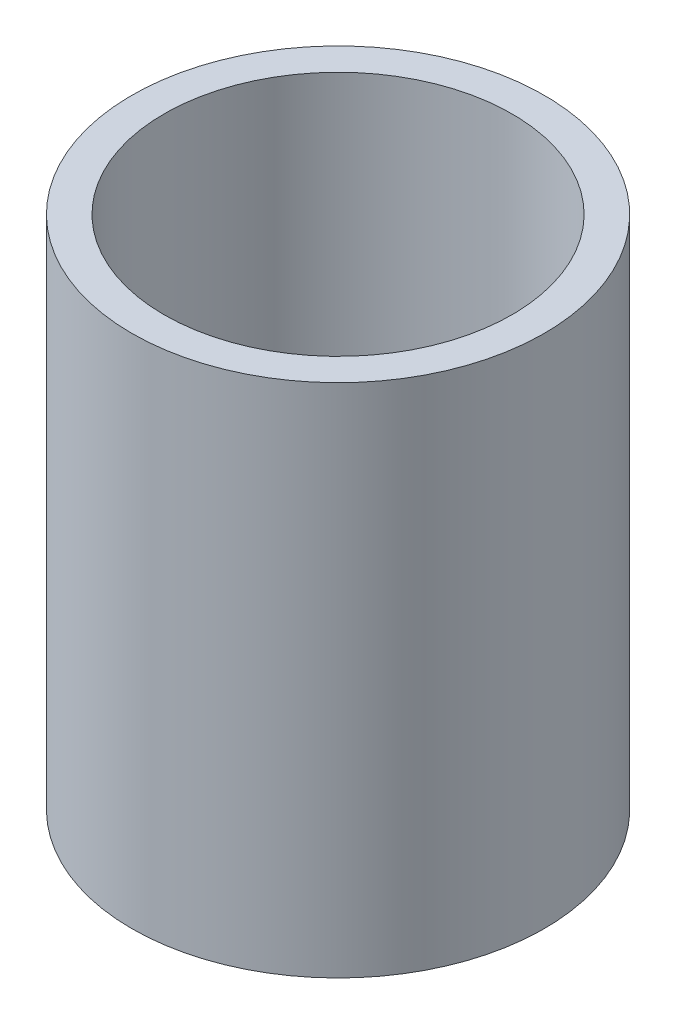
ISO-10303-21;
HEADER;
FILE_DESCRIPTION(('STEP AP214'),'2;1');
FILE_NAME('part.step','',(''),(''),'','','');
FILE_SCHEMA(('AUTOMOTIVE_DESIGN { 1 0 10303 214 1 1 1 1 }'));
ENDSEC;
DATA;
#1=APPLICATION_CONTEXT('core data for automotive mechanical design processes');
#2=APPLICATION_PROTOCOL_DEFINITION('international standard','automotive_design',2000,#1);
#3=PRODUCT_CONTEXT('',#1,'mechanical');
#4=PRODUCT('Part','Part','',(#3));
#5=PRODUCT_RELATED_PRODUCT_CATEGORY('part','',(#4));
#6=PRODUCT_DEFINITION_FORMATION('','',#4);
#7=PRODUCT_DEFINITION_CONTEXT('part definition',#1,'design');
#8=PRODUCT_DEFINITION('design','',#6,#7);
#9=PRODUCT_DEFINITION_SHAPE('','',#8);
#10=(LENGTH_UNIT() NAMED_UNIT(*) SI_UNIT(.MILLI.,.METRE.));
#11=(NAMED_UNIT(*) PLANE_ANGLE_UNIT() SI_UNIT($,.RADIAN.));
#12=(NAMED_UNIT(*) SI_UNIT($,.STERADIAN.) SOLID_ANGLE_UNIT());
#13=UNCERTAINTY_MEASURE_WITH_UNIT(LENGTH_MEASURE(1.E-05),#10,'distance_accuracy_value','');
#14=(GEOMETRIC_REPRESENTATION_CONTEXT(3) GLOBAL_UNCERTAINTY_ASSIGNED_CONTEXT((#13)) GLOBAL_UNIT_ASSIGNED_CONTEXT((#10,
#11,#12)) REPRESENTATION_CONTEXT('',''));
#15=CARTESIAN_POINT('',(0.,0.,0.));
#16=DIRECTION('',(0.,0.,1.));
#17=DIRECTION('',(1.,0.,0.));
#18=AXIS2_PLACEMENT_3D('',#15,#16,#17);
#19=CARTESIAN_POINT('',(0.,50.8,0.));
#20=DIRECTION('',(0.,-1.,0.));
#21=DIRECTION('',(0.,0.,-1.));
#22=AXIS2_PLACEMENT_3D('',#19,#20,#21);
#23=CYLINDRICAL_SURFACE('',#22,20.32);
#24=CARTESIAN_POINT('',(0.,50.8,0.));
#25=DIRECTION('',(0.,1.,0.));
#26=DIRECTION('',(0.,0.,1.));
#27=AXIS2_PLACEMENT_3D('',#24,#25,#26);
#28=CIRCLE('',#27,20.32);
#29=CARTESIAN_POINT('',(0.,50.8,20.32));
#30=VERTEX_POINT('',#29);
#31=EDGE_CURVE('E10',#30,#30,#28,.T.);
#32=ORIENTED_EDGE('',*,*,#31,.F.);
#33=EDGE_LOOP('',(#32));
#34=FACE_BOUND('',#33,.T.);
#35=CARTESIAN_POINT('',(0.,0.,0.));
#36=DIRECTION('',(0.,1.,0.));
#37=DIRECTION('',(0.,0.,1.));
#38=AXIS2_PLACEMENT_3D('',#35,#36,#37);
#39=CIRCLE('',#38,20.32);
#40=CARTESIAN_POINT('',(0.,0.,20.32));
#41=VERTEX_POINT('',#40);
#42=EDGE_CURVE('E38',#41,#41,#39,.T.);
#43=ORIENTED_EDGE('',*,*,#42,.T.);
#44=EDGE_LOOP('',(#43));
#45=FACE_BOUND('',#44,.T.);
#46=ADVANCED_FACE('F31',(#34,#45),#23,.T.);
#47=CARTESIAN_POINT('',(0.,50.8,0.));
#48=DIRECTION('',(0.,1.,0.));
#49=DIRECTION('',(0.,0.,1.));
#50=AXIS2_PLACEMENT_3D('',#47,#48,#49);
#51=PLANE('',#50);
#52=CARTESIAN_POINT('',(0.,50.8,0.));
#53=DIRECTION('',(0.,1.,0.));
#54=DIRECTION('',(0.,0.,1.));
#55=AXIS2_PLACEMENT_3D('',#52,#53,#54);
#56=CIRCLE('',#55,17.145);
#57=CARTESIAN_POINT('',(0.,50.8,17.145));
#58=VERTEX_POINT('',#57);
#59=EDGE_CURVE('E43',#58,#58,#56,.T.);
#60=ORIENTED_EDGE('',*,*,#59,.F.);
#61=EDGE_LOOP('',(#60));
#62=FACE_BOUND('',#61,.T.);
#63=ORIENTED_EDGE('',*,*,#31,.T.);
#64=EDGE_LOOP('',(#63));
#65=FACE_BOUND('',#64,.T.);
#66=ADVANCED_FACE('F74',(#62,#65),#51,.T.);
#67=CARTESIAN_POINT('',(0.,0.,0.));
#68=DIRECTION('',(0.,1.,0.));
#69=DIRECTION('',(0.,0.,1.));
#70=AXIS2_PLACEMENT_3D('',#67,#68,#69);
#71=PLANE('',#70);
#72=CARTESIAN_POINT('',(0.,0.,0.));
#73=DIRECTION('',(0.,1.,0.));
#74=DIRECTION('',(0.,0.,1.));
#75=AXIS2_PLACEMENT_3D('',#72,#73,#74);
#76=CIRCLE('',#75,4.064);
#77=CARTESIAN_POINT('',(0.,0.,4.064));
#78=VERTEX_POINT('',#77);
#79=EDGE_CURVE('E50',#78,#78,#76,.T.);
#80=ORIENTED_EDGE('',*,*,#79,.T.);
#81=EDGE_LOOP('',(#80));
#82=FACE_BOUND('',#81,.T.);
#83=ORIENTED_EDGE('',*,*,#42,.F.);
#84=EDGE_LOOP('',(#83));
#85=FACE_BOUND('',#84,.T.);
#86=ADVANCED_FACE('F68',(#82,#85),#71,.F.);
#87=CARTESIAN_POINT('',(0.,50.8,0.));
#88=DIRECTION('',(0.,-1.,0.));
#89=DIRECTION('',(0.,0.,-1.));
#90=AXIS2_PLACEMENT_3D('',#87,#88,#89);
#91=CYLINDRICAL_SURFACE('',#90,17.145);
#92=ORIENTED_EDGE('',*,*,#59,.T.);
#93=EDGE_LOOP('',(#92));
#94=FACE_BOUND('',#93,.T.);
#95=CARTESIAN_POINT('',(0.,3.175,0.));
#96=DIRECTION('',(0.,1.,0.));
#97=DIRECTION('',(0.,0.,1.));
#98=AXIS2_PLACEMENT_3D('',#95,#96,#97);
#99=CIRCLE('',#98,17.145);
#100=CARTESIAN_POINT('',(0.,3.175,17.145));
#101=VERTEX_POINT('',#100);
#102=EDGE_CURVE('E47',#101,#101,#99,.T.);
#103=ORIENTED_EDGE('',*,*,#102,.F.);
#104=EDGE_LOOP('',(#103));
#105=FACE_BOUND('',#104,.T.);
#106=ADVANCED_FACE('F63',(#94,#105),#91,.F.);
#107=CARTESIAN_POINT('',(0.,3.175,0.));
#108=DIRECTION('',(0.,1.,0.));
#109=DIRECTION('',(0.,0.,1.));
#110=AXIS2_PLACEMENT_3D('',#107,#108,#109);
#111=PLANE('',#110);
#112=CARTESIAN_POINT('',(0.,3.175,0.));
#113=DIRECTION('',(0.,1.,0.));
#114=DIRECTION('',(0.,0.,1.));
#115=AXIS2_PLACEMENT_3D('',#112,#113,#114);
#116=CIRCLE('',#115,4.064);
#117=CARTESIAN_POINT('',(0.,3.175,4.064));
#118=VERTEX_POINT('',#117);
#119=EDGE_CURVE('E34',#118,#118,#116,.T.);
#120=ORIENTED_EDGE('',*,*,#119,.F.);
#121=EDGE_LOOP('',(#120));
#122=FACE_BOUND('',#121,.T.);
#123=ORIENTED_EDGE('',*,*,#102,.T.);
#124=EDGE_LOOP('',(#123));
#125=FACE_BOUND('',#124,.T.);
#126=ADVANCED_FACE('F60',(#122,#125),#111,.T.);
#127=CARTESIAN_POINT('',(0.,-43.307,0.));
#128=DIRECTION('',(0.,1.,0.));
#129=DIRECTION('',(0.,0.,1.));
#130=AXIS2_PLACEMENT_3D('',#127,#128,#129);
#131=CYLINDRICAL_SURFACE('',#130,4.064);
#132=ORIENTED_EDGE('',*,*,#119,.T.);
#133=EDGE_LOOP('',(#132));
#134=FACE_BOUND('',#133,.T.);
#135=ORIENTED_EDGE('',*,*,#79,.F.);
#136=EDGE_LOOP('',(#135));
#137=FACE_BOUND('',#136,.T.);
#138=ADVANCED_FACE('F57',(#134,#137),#131,.F.);
#139=CLOSED_SHELL('',(#46,#66,#86,#106,#126,#138));
#140=MANIFOLD_SOLID_BREP('B2',#139);
#141=ADVANCED_BREP_SHAPE_REPRESENTATION('',(#18,#140),#14);
#142=SHAPE_DEFINITION_REPRESENTATION(#9,#141);
ENDSEC;
END-ISO-10303-21;
